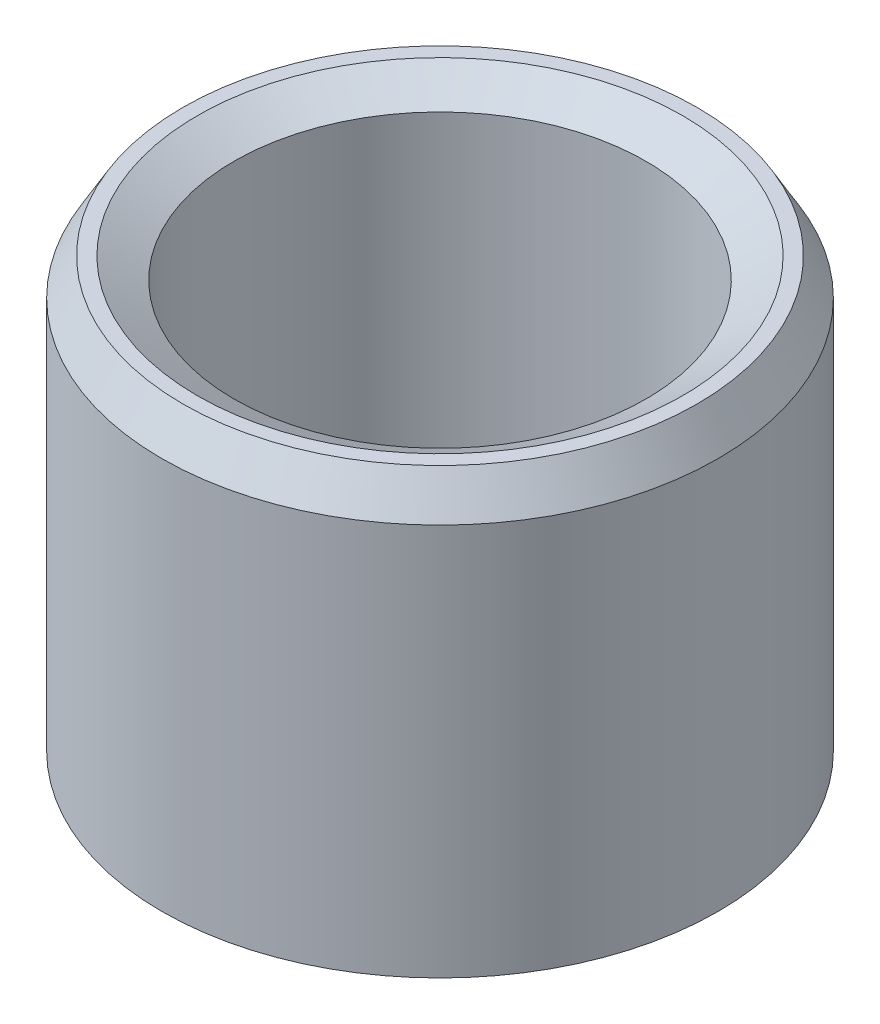
ISO-10303-21;
HEADER;
FILE_DESCRIPTION(('STEP AP214'),'2;1');
FILE_NAME('part.step','',(''),(''),'','','');
FILE_SCHEMA(('AUTOMOTIVE_DESIGN { 1 0 10303 214 1 1 1 1 }'));
ENDSEC;
DATA;
#1=APPLICATION_CONTEXT('core data for automotive mechanical design processes');
#2=APPLICATION_PROTOCOL_DEFINITION('international standard','automotive_design',2000,#1);
#3=PRODUCT_CONTEXT('',#1,'mechanical');
#4=PRODUCT('Part','Part','',(#3));
#5=PRODUCT_RELATED_PRODUCT_CATEGORY('part','',(#4));
#6=PRODUCT_DEFINITION_FORMATION('','',#4);
#7=PRODUCT_DEFINITION_CONTEXT('part definition',#1,'design');
#8=PRODUCT_DEFINITION('design','',#6,#7);
#9=PRODUCT_DEFINITION_SHAPE('','',#8);
#10=(LENGTH_UNIT() NAMED_UNIT(*) SI_UNIT(.MILLI.,.METRE.));
#11=(NAMED_UNIT(*) PLANE_ANGLE_UNIT() SI_UNIT($,.RADIAN.));
#12=(NAMED_UNIT(*) SI_UNIT($,.STERADIAN.) SOLID_ANGLE_UNIT());
#13=UNCERTAINTY_MEASURE_WITH_UNIT(LENGTH_MEASURE(1.E-05),#10,'distance_accuracy_value','');
#14=(GEOMETRIC_REPRESENTATION_CONTEXT(3) GLOBAL_UNCERTAINTY_ASSIGNED_CONTEXT((#13)) GLOBAL_UNIT_ASSIGNED_CONTEXT((#10,
#11,#12)) REPRESENTATION_CONTEXT('',''));
#15=CARTESIAN_POINT('',(0.,0.,0.));
#16=DIRECTION('',(0.,0.,1.));
#17=DIRECTION('',(1.,0.,0.));
#18=AXIS2_PLACEMENT_3D('',#15,#16,#17);
#19=CARTESIAN_POINT('',(0.,16.1780331609399,0.));
#20=DIRECTION('',(0.,-1.,0.));
#21=DIRECTION('',(0.,0.,-1.));
#22=AXIS2_PLACEMENT_3D('',#19,#20,#21);
#23=CYLINDRICAL_SURFACE('',#22,10.);
#24=CARTESIAN_POINT('',(0.,0.760699575771445,0.));
#25=DIRECTION('',(0.,1.,0.));
#26=DIRECTION('',(0.,0.,1.));
#27=AXIS2_PLACEMENT_3D('',#24,#25,#26);
#28=CIRCLE('',#27,10.);
#29=CARTESIAN_POINT('',(0.,0.760699575771445,10.));
#30=VERTEX_POINT('',#29);
#31=EDGE_CURVE('E10',#30,#30,#28,.T.);
#32=ORIENTED_EDGE('',*,*,#31,.T.);
#33=EDGE_LOOP('',(#32));
#34=FACE_BOUND('',#33,.T.);
#35=CARTESIAN_POINT('',(0.,14.8604628464077,0.));
#36=DIRECTION('',(0.,1.,0.));
#37=DIRECTION('',(0.,0.,1.));
#38=AXIS2_PLACEMENT_3D('',#35,#36,#37);
#39=CIRCLE('',#38,10.);
#40=CARTESIAN_POINT('',(0.,14.8604628464077,10.));
#41=VERTEX_POINT('',#40);
#42=EDGE_CURVE('E50',#41,#41,#39,.F.);
#43=ORIENTED_EDGE('',*,*,#42,.T.);
#44=EDGE_LOOP('',(#43));
#45=FACE_BOUND('',#44,.T.);
#46=ADVANCED_FACE('F39',(#34,#45),#23,.T.);
#47=CARTESIAN_POINT('',(0.,16.1780331609399,0.));
#48=DIRECTION('',(0.,1.,0.));
#49=DIRECTION('',(0.,0.,1.));
#50=AXIS2_PLACEMENT_3D('',#47,#48,#49);
#51=PLANE('',#50);
#52=CARTESIAN_POINT('',(0.,16.1780331609399,0.));
#53=DIRECTION('',(0.,1.,0.));
#54=DIRECTION('',(0.,0.,1.));
#55=AXIS2_PLACEMENT_3D('',#52,#53,#54);
#56=CIRCLE('',#55,8.7227018002815);
#57=CARTESIAN_POINT('',(0.,16.1780331609399,8.7227018002815));
#58=VERTEX_POINT('',#57);
#59=EDGE_CURVE('E58',#58,#58,#56,.F.);
#60=ORIENTED_EDGE('',*,*,#59,.T.);
#61=EDGE_LOOP('',(#60));
#62=FACE_BOUND('',#61,.T.);
#63=CARTESIAN_POINT('',(0.,16.1780331609399,0.));
#64=DIRECTION('',(0.,1.,0.));
#65=DIRECTION('',(0.,0.,1.));
#66=AXIS2_PLACEMENT_3D('',#63,#64,#65);
#67=CIRCLE('',#66,9.23930042422855);
#68=CARTESIAN_POINT('',(0.,16.1780331609399,9.23930042422855));
#69=VERTEX_POINT('',#68);
#70=EDGE_CURVE('E61',#69,#69,#67,.T.);
#71=ORIENTED_EDGE('',*,*,#70,.T.);
#72=EDGE_LOOP('',(#71));
#73=FACE_BOUND('',#72,.T.);
#74=ADVANCED_FACE('F88',(#62,#73),#51,.T.);
#75=CARTESIAN_POINT('',(0.,0.,0.));
#76=DIRECTION('',(0.,1.,0.));
#77=DIRECTION('',(0.,0.,1.));
#78=AXIS2_PLACEMENT_3D('',#75,#76,#77);
#79=PLANE('',#78);
#80=CARTESIAN_POINT('',(0.,0.,0.));
#81=DIRECTION('',(0.,1.,0.));
#82=DIRECTION('',(0.,0.,1.));
#83=AXIS2_PLACEMENT_3D('',#80,#81,#82);
#84=CIRCLE('',#83,8.1658310615207);
#85=CARTESIAN_POINT('',(0.,0.,8.1658310615207));
#86=VERTEX_POINT('',#85);
#87=EDGE_CURVE('E51',#86,#86,#84,.T.);
#88=ORIENTED_EDGE('',*,*,#87,.T.);
#89=EDGE_LOOP('',(#88));
#90=FACE_BOUND('',#89,.T.);
#91=CARTESIAN_POINT('',(0.,0.,0.));
#92=DIRECTION('',(0.,1.,0.));
#93=DIRECTION('',(0.,0.,1.));
#94=AXIS2_PLACEMENT_3D('',#91,#92,#93);
#95=CIRCLE('',#94,8.68242968546776);
#96=CARTESIAN_POINT('',(0.,0.,8.68242968546776));
#97=VERTEX_POINT('',#96);
#98=EDGE_CURVE('E54',#97,#97,#95,.F.);
#99=ORIENTED_EDGE('',*,*,#98,.T.);
#100=EDGE_LOOP('',(#99));
#101=FACE_BOUND('',#100,.T.);
#102=ADVANCED_FACE('F83',(#90,#101),#79,.F.);
#103=CARTESIAN_POINT('',(0.,16.1780331609399,0.));
#104=DIRECTION('',(0.,-1.,0.));
#105=DIRECTION('',(0.,0.,-1.));
#106=AXIS2_PLACEMENT_3D('',#103,#104,#105);
#107=CYLINDRICAL_SURFACE('',#106,7.40513148574925);
#108=CARTESIAN_POINT('',(0.,15.4173335851685,0.));
#109=DIRECTION('',(0.,1.,0.));
#110=DIRECTION('',(0.,0.,1.));
#111=AXIS2_PLACEMENT_3D('',#108,#109,#110);
#112=CIRCLE('',#111,7.40513148574925);
#113=CARTESIAN_POINT('',(0.,15.4173335851685,7.40513148574925));
#114=VERTEX_POINT('',#113);
#115=EDGE_CURVE('E67',#114,#114,#112,.T.);
#116=ORIENTED_EDGE('',*,*,#115,.T.);
#117=EDGE_LOOP('',(#116));
#118=FACE_BOUND('',#117,.T.);
#119=CARTESIAN_POINT('',(0.,1.31757031453224,0.));
#120=DIRECTION('',(0.,1.,0.));
#121=DIRECTION('',(0.,0.,1.));
#122=AXIS2_PLACEMENT_3D('',#119,#120,#121);
#123=CIRCLE('',#122,7.40513148574925);
#124=CARTESIAN_POINT('',(0.,1.31757031453224,7.40513148574925));
#125=VERTEX_POINT('',#124);
#126=EDGE_CURVE('E69',#125,#125,#123,.F.);
#127=ORIENTED_EDGE('',*,*,#126,.T.);
#128=EDGE_LOOP('',(#127));
#129=FACE_BOUND('',#128,.T.);
#130=ADVANCED_FACE('F71',(#118,#129),#107,.F.);
#131=CARTESIAN_POINT('',(0.,15.4173335851685,0.));
#132=DIRECTION('',(0.,1.,0.));
#133=DIRECTION('',(0.,0.,1.));
#134=AXIS2_PLACEMENT_3D('',#131,#132,#133);
#135=CONICAL_SURFACE('',#134,7.40513148574925,1.0471975511966);
#136=ORIENTED_EDGE('',*,*,#59,.F.);
#137=EDGE_LOOP('',(#136));
#138=FACE_BOUND('',#137,.T.);
#139=ORIENTED_EDGE('',*,*,#115,.F.);
#140=EDGE_LOOP('',(#139));
#141=FACE_BOUND('',#140,.T.);
#142=ADVANCED_FACE('F77',(#138,#141),#135,.F.);
#143=CARTESIAN_POINT('',(0.,0.,0.));
#144=DIRECTION('',(0.,-1.,0.));
#145=DIRECTION('',(0.,0.,-1.));
#146=AXIS2_PLACEMENT_3D('',#143,#144,#145);
#147=CONICAL_SURFACE('',#146,8.1658310615207,0.523598775598296);
#148=ORIENTED_EDGE('',*,*,#126,.F.);
#149=EDGE_LOOP('',(#148));
#150=FACE_BOUND('',#149,.T.);
#151=ORIENTED_EDGE('',*,*,#87,.F.);
#152=EDGE_LOOP('',(#151));
#153=FACE_BOUND('',#152,.T.);
#154=ADVANCED_FACE('F73',(#150,#153),#147,.F.);
#155=CARTESIAN_POINT('',(0.,0.760699575771445,0.));
#156=DIRECTION('',(0.,1.,0.));
#157=DIRECTION('',(0.,0.,1.));
#158=AXIS2_PLACEMENT_3D('',#155,#156,#157);
#159=CONICAL_SURFACE('',#158,10.,1.0471975511966);
#160=ORIENTED_EDGE('',*,*,#98,.F.);
#161=EDGE_LOOP('',(#160));
#162=FACE_BOUND('',#161,.T.);
#163=ORIENTED_EDGE('',*,*,#31,.F.);
#164=EDGE_LOOP('',(#163));
#165=FACE_BOUND('',#164,.T.);
#166=ADVANCED_FACE('F76',(#162,#165),#159,.T.);
#167=CARTESIAN_POINT('',(0.,16.1780331609399,0.));
#168=DIRECTION('',(0.,-1.,0.));
#169=DIRECTION('',(0.,0.,-1.));
#170=AXIS2_PLACEMENT_3D('',#167,#168,#169);
#171=CONICAL_SURFACE('',#170,9.23930042422855,0.523598775598295);
#172=ORIENTED_EDGE('',*,*,#42,.F.);
#173=EDGE_LOOP('',(#172));
#174=FACE_BOUND('',#173,.T.);
#175=ORIENTED_EDGE('',*,*,#70,.F.);
#176=EDGE_LOOP('',(#175));
#177=FACE_BOUND('',#176,.T.);
#178=ADVANCED_FACE('F45',(#174,#177),#171,.T.);
#179=CLOSED_SHELL('',(#46,#74,#102,#130,#142,#154,#166,#178));
#180=MANIFOLD_SOLID_BREP('B2',#179);
#181=ADVANCED_BREP_SHAPE_REPRESENTATION('',(#18,#180),#14);
#182=SHAPE_DEFINITION_REPRESENTATION(#9,#181);
ENDSEC;
END-ISO-10303-21;
